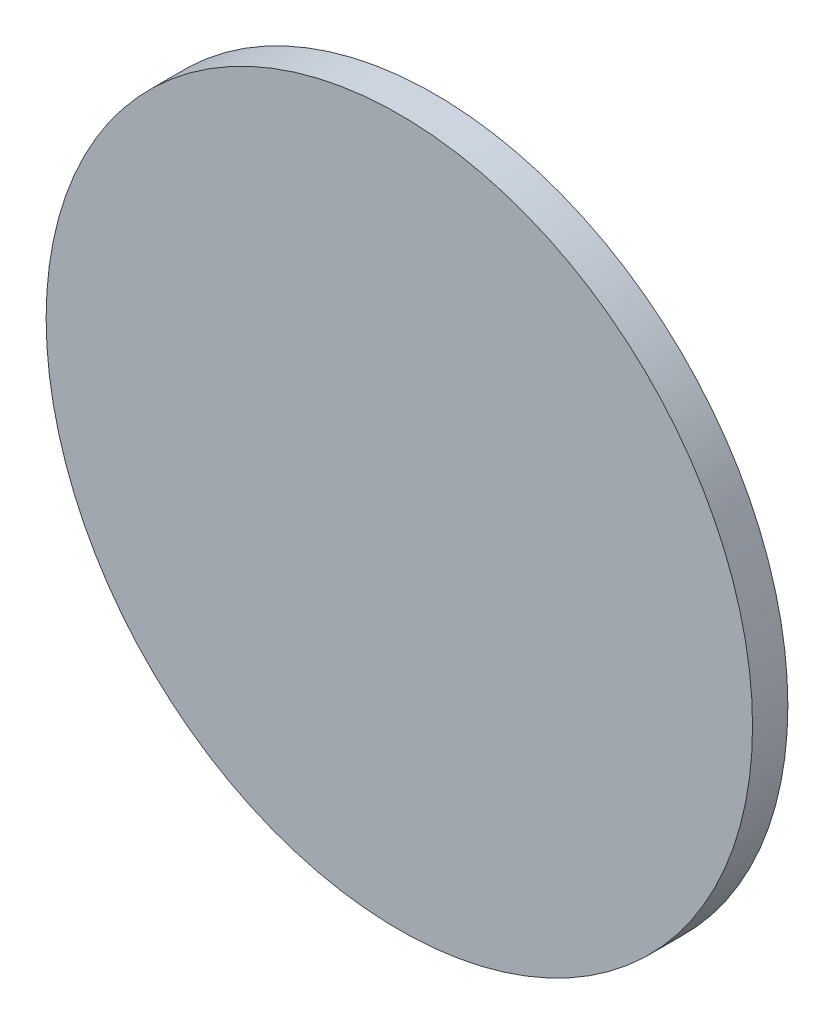
ISO-10303-21;
HEADER;
FILE_DESCRIPTION(('STEP AP214'),'2;1');
FILE_NAME('part.step','',(''),(''),'','','');
FILE_SCHEMA(('AUTOMOTIVE_DESIGN { 1 0 10303 214 1 1 1 1 }'));
ENDSEC;
DATA;
#1=APPLICATION_CONTEXT('core data for automotive mechanical design processes');
#2=APPLICATION_PROTOCOL_DEFINITION('international standard','automotive_design',2000,#1);
#3=PRODUCT_CONTEXT('',#1,'mechanical');
#4=PRODUCT('Part','Part','',(#3));
#5=PRODUCT_RELATED_PRODUCT_CATEGORY('part','',(#4));
#6=PRODUCT_DEFINITION_FORMATION('','',#4);
#7=PRODUCT_DEFINITION_CONTEXT('part definition',#1,'design');
#8=PRODUCT_DEFINITION('design','',#6,#7);
#9=PRODUCT_DEFINITION_SHAPE('','',#8);
#10=(LENGTH_UNIT() NAMED_UNIT(*) SI_UNIT(.MILLI.,.METRE.));
#11=(NAMED_UNIT(*) PLANE_ANGLE_UNIT() SI_UNIT($,.RADIAN.));
#12=(NAMED_UNIT(*) SI_UNIT($,.STERADIAN.) SOLID_ANGLE_UNIT());
#13=UNCERTAINTY_MEASURE_WITH_UNIT(LENGTH_MEASURE(1.E-05),#10,'distance_accuracy_value','');
#14=(GEOMETRIC_REPRESENTATION_CONTEXT(3) GLOBAL_UNCERTAINTY_ASSIGNED_CONTEXT((#13)) GLOBAL_UNIT_ASSIGNED_CONTEXT((#10,
#11,#12)) REPRESENTATION_CONTEXT('',''));
#15=CARTESIAN_POINT('',(0.,0.,0.));
#16=DIRECTION('',(0.,0.,1.));
#17=DIRECTION('',(1.,0.,0.));
#18=AXIS2_PLACEMENT_3D('',#15,#16,#17);
#19=CARTESIAN_POINT('',(0.,0.,20.));
#20=DIRECTION('',(0.,0.,-1.));
#21=DIRECTION('',(-1.,0.,0.));
#22=AXIS2_PLACEMENT_3D('',#19,#20,#21);
#23=CYLINDRICAL_SURFACE('',#22,200.);
#24=CARTESIAN_POINT('',(0.,0.,20.));
#25=DIRECTION('',(0.,0.,1.));
#26=DIRECTION('',(1.,0.,0.));
#27=AXIS2_PLACEMENT_3D('',#24,#25,#26);
#28=CIRCLE('',#27,200.);
#29=CARTESIAN_POINT('',(200.,0.,20.));
#30=VERTEX_POINT('',#29);
#31=EDGE_CURVE('E10',#30,#30,#28,.T.);
#32=ORIENTED_EDGE('',*,*,#31,.F.);
#33=EDGE_LOOP('',(#32));
#34=FACE_BOUND('',#33,.T.);
#35=CARTESIAN_POINT('',(0.,0.,0.));
#36=DIRECTION('',(0.,0.,1.));
#37=DIRECTION('',(1.,0.,0.));
#38=AXIS2_PLACEMENT_3D('',#35,#36,#37);
#39=CIRCLE('',#38,200.);
#40=CARTESIAN_POINT('',(200.,0.,0.));
#41=VERTEX_POINT('',#40);
#42=EDGE_CURVE('E40',#41,#41,#39,.T.);
#43=ORIENTED_EDGE('',*,*,#42,.T.);
#44=EDGE_LOOP('',(#43));
#45=FACE_BOUND('',#44,.T.);
#46=ADVANCED_FACE('F37',(#34,#45),#23,.T.);
#47=CARTESIAN_POINT('',(0.,0.,20.));
#48=DIRECTION('',(0.,0.,1.));
#49=DIRECTION('',(1.,0.,0.));
#50=AXIS2_PLACEMENT_3D('',#47,#48,#49);
#51=PLANE('',#50);
#52=ORIENTED_EDGE('',*,*,#31,.T.);
#53=EDGE_LOOP('',(#52));
#54=FACE_BOUND('',#53,.T.);
#55=ADVANCED_FACE('F52',(#54),#51,.T.);
#56=CARTESIAN_POINT('',(0.,0.,0.));
#57=DIRECTION('',(0.,0.,1.));
#58=DIRECTION('',(1.,0.,0.));
#59=AXIS2_PLACEMENT_3D('',#56,#57,#58);
#60=PLANE('',#59);
#61=ORIENTED_EDGE('',*,*,#42,.F.);
#62=EDGE_LOOP('',(#61));
#63=FACE_BOUND('',#62,.T.);
#64=ADVANCED_FACE('F50',(#63),#60,.F.);
#65=CLOSED_SHELL('',(#46,#55,#64));
#66=MANIFOLD_SOLID_BREP('B2',#65);
#67=ADVANCED_BREP_SHAPE_REPRESENTATION('',(#18,#66),#14);
#68=SHAPE_DEFINITION_REPRESENTATION(#9,#67);
ENDSEC;
END-ISO-10303-21;
